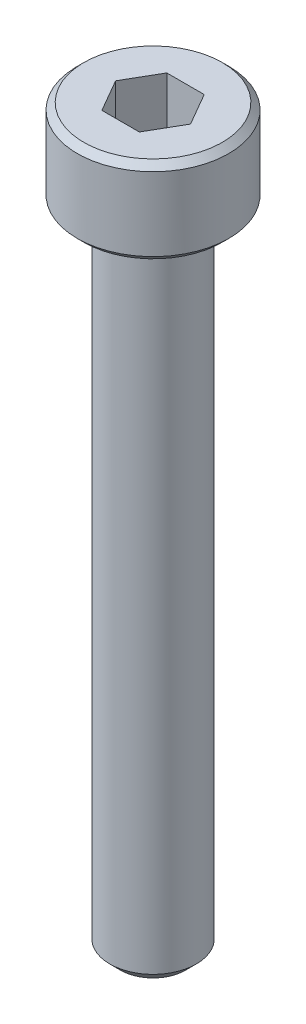
ISO-10303-21;
HEADER;
FILE_DESCRIPTION(('STEP AP214'),'2;1');
FILE_NAME('part.step','',(''),(''),'','','');
FILE_SCHEMA(('AUTOMOTIVE_DESIGN { 1 0 10303 214 1 1 1 1 }'));
ENDSEC;
DATA;
#1=APPLICATION_CONTEXT('core data for automotive mechanical design processes');
#2=APPLICATION_PROTOCOL_DEFINITION('international standard','automotive_design',2000,#1);
#3=PRODUCT_CONTEXT('',#1,'mechanical');
#4=PRODUCT('Part','Part','',(#3));
#5=PRODUCT_RELATED_PRODUCT_CATEGORY('part','',(#4));
#6=PRODUCT_DEFINITION_FORMATION('','',#4);
#7=PRODUCT_DEFINITION_CONTEXT('part definition',#1,'design');
#8=PRODUCT_DEFINITION('design','',#6,#7);
#9=PRODUCT_DEFINITION_SHAPE('','',#8);
#10=(LENGTH_UNIT() NAMED_UNIT(*) SI_UNIT(.MILLI.,.METRE.));
#11=(NAMED_UNIT(*) PLANE_ANGLE_UNIT() SI_UNIT($,.RADIAN.));
#12=(NAMED_UNIT(*) SI_UNIT($,.STERADIAN.) SOLID_ANGLE_UNIT());
#13=UNCERTAINTY_MEASURE_WITH_UNIT(LENGTH_MEASURE(1.E-05),#10,'distance_accuracy_value','');
#14=(GEOMETRIC_REPRESENTATION_CONTEXT(3) GLOBAL_UNCERTAINTY_ASSIGNED_CONTEXT((#13)) GLOBAL_UNIT_ASSIGNED_CONTEXT((#10,
#11,#12)) REPRESENTATION_CONTEXT('',''));
#15=CARTESIAN_POINT('',(0.,0.,0.));
#16=DIRECTION('',(0.,0.,1.));
#17=DIRECTION('',(1.,0.,0.));
#18=AXIS2_PLACEMENT_3D('',#15,#16,#17);
#19=CARTESIAN_POINT('',(0.866025403784439,31.,1.5));
#20=DIRECTION('',(0.866025403784439,0.,0.5));
#21=DIRECTION('',(0.5,0.,-0.866025403784439));
#22=AXIS2_PLACEMENT_3D('',#19,#20,#21);
#23=PLANE('',#22);
#24=DIRECTION('',(0.5,0.,-0.866025403784439));
#25=VECTOR('',#24,1.);
#26=CARTESIAN_POINT('',(0.866025403784439,31.,1.5));
#27=LINE('',#26,#25);
#28=CARTESIAN_POINT('',(0.866025403784439,31.,1.5));
#29=VERTEX_POINT('',#28);
#30=CARTESIAN_POINT('',(1.73205080756888,31.,0.));
#31=VERTEX_POINT('',#30);
#32=EDGE_CURVE('E66',#29,#31,#27,.T.);
#33=ORIENTED_EDGE('',*,*,#32,.F.);
#34=DIRECTION('',(0.,1.,0.));
#35=VECTOR('',#34,1.);
#36=CARTESIAN_POINT('',(0.866025403784439,31.,1.5));
#37=LINE('',#36,#35);
#38=CARTESIAN_POINT('',(0.866025403784439,34.,1.5));
#39=VERTEX_POINT('',#38);
#40=EDGE_CURVE('E85',#29,#39,#37,.T.);
#41=ORIENTED_EDGE('',*,*,#40,.T.);
#42=DIRECTION('',(0.5,0.,-0.866025403784439));
#43=VECTOR('',#42,1.);
#44=CARTESIAN_POINT('',(0.866025403784439,34.,1.5));
#45=LINE('',#44,#43);
#46=CARTESIAN_POINT('',(1.73205080756888,34.,0.));
#47=VERTEX_POINT('',#46);
#48=EDGE_CURVE('E73',#47,#39,#45,.F.);
#49=ORIENTED_EDGE('',*,*,#48,.F.);
#50=DIRECTION('',(0.,1.,0.));
#51=VECTOR('',#50,1.);
#52=CARTESIAN_POINT('',(1.73205080756888,31.,0.));
#53=LINE('',#52,#51);
#54=EDGE_CURVE('E80',#47,#31,#53,.F.);
#55=ORIENTED_EDGE('',*,*,#54,.T.);
#56=EDGE_LOOP('',(#33,#41,#49,#55));
#57=FACE_BOUND('',#56,.T.);
#58=ADVANCED_FACE('F17',(#57),#23,.F.);
#59=CARTESIAN_POINT('',(1.73205080756888,31.,0.));
#60=DIRECTION('',(0.866025403784438,0.,-0.5));
#61=DIRECTION('',(-0.5,0.,-0.866025403784438));
#62=AXIS2_PLACEMENT_3D('',#59,#60,#61);
#63=PLANE('',#62);
#64=DIRECTION('',(-0.5,0.,-0.866025403784438));
#65=VECTOR('',#64,1.);
#66=CARTESIAN_POINT('',(1.73205080756888,31.,0.));
#67=LINE('',#66,#65);
#68=CARTESIAN_POINT('',(0.866025403784438,31.,-1.5));
#69=VERTEX_POINT('',#68);
#70=EDGE_CURVE('E89',#31,#69,#67,.T.);
#71=ORIENTED_EDGE('',*,*,#70,.F.);
#72=ORIENTED_EDGE('',*,*,#54,.F.);
#73=DIRECTION('',(-0.5,0.,-0.866025403784438));
#74=VECTOR('',#73,1.);
#75=CARTESIAN_POINT('',(1.73205080756888,34.,0.));
#76=LINE('',#75,#74);
#77=CARTESIAN_POINT('',(0.866025403784439,34.,-1.5));
#78=VERTEX_POINT('',#77);
#79=EDGE_CURVE('E70',#78,#47,#76,.F.);
#80=ORIENTED_EDGE('',*,*,#79,.F.);
#81=DIRECTION('',(0.,1.,0.));
#82=VECTOR('',#81,1.);
#83=CARTESIAN_POINT('',(0.866025403784438,31.,-1.5));
#84=LINE('',#83,#82);
#85=EDGE_CURVE('E133',#78,#69,#84,.F.);
#86=ORIENTED_EDGE('',*,*,#85,.T.);
#87=EDGE_LOOP('',(#71,#72,#80,#86));
#88=FACE_BOUND('',#87,.T.);
#89=ADVANCED_FACE('F88',(#88),#63,.F.);
#90=CARTESIAN_POINT('',(-0.866025403784438,31.,1.5));
#91=DIRECTION('',(0.,0.,1.));
#92=DIRECTION('',(1.,0.,0.));
#93=AXIS2_PLACEMENT_3D('',#90,#91,#92);
#94=PLANE('',#93);
#95=DIRECTION('',(1.,0.,0.));
#96=VECTOR('',#95,1.);
#97=CARTESIAN_POINT('',(1.73205080756888,31.,1.5));
#98=LINE('',#97,#96);
#99=CARTESIAN_POINT('',(-0.866025403784438,31.,1.5));
#100=VERTEX_POINT('',#99);
#101=EDGE_CURVE('E131',#100,#29,#98,.T.);
#102=ORIENTED_EDGE('',*,*,#101,.F.);
#103=DIRECTION('',(0.,1.,0.));
#104=VECTOR('',#103,1.);
#105=CARTESIAN_POINT('',(-0.866025403784438,31.,1.5));
#106=LINE('',#105,#104);
#107=CARTESIAN_POINT('',(-0.866025403784438,34.,1.5));
#108=VERTEX_POINT('',#107);
#109=EDGE_CURVE('E121',#100,#108,#106,.T.);
#110=ORIENTED_EDGE('',*,*,#109,.T.);
#111=DIRECTION('',(1.,0.,0.));
#112=VECTOR('',#111,1.);
#113=CARTESIAN_POINT('',(-0.866025403784438,34.,1.5));
#114=LINE('',#113,#112);
#115=EDGE_CURVE('E91',#39,#108,#114,.F.);
#116=ORIENTED_EDGE('',*,*,#115,.F.);
#117=ORIENTED_EDGE('',*,*,#40,.F.);
#118=EDGE_LOOP('',(#102,#110,#116,#117));
#119=FACE_BOUND('',#118,.T.);
#120=ADVANCED_FACE('F138',(#119),#94,.F.);
#121=CARTESIAN_POINT('',(0.866025403784438,31.,-1.5));
#122=DIRECTION('',(0.,0.,-1.));
#123=DIRECTION('',(-1.,0.,0.));
#124=AXIS2_PLACEMENT_3D('',#121,#122,#123);
#125=PLANE('',#124);
#126=DIRECTION('',(1.,0.,0.));
#127=VECTOR('',#126,1.);
#128=CARTESIAN_POINT('',(1.73205080756888,31.,-1.5));
#129=LINE('',#128,#127);
#130=CARTESIAN_POINT('',(-0.866025403784438,31.,-1.5));
#131=VERTEX_POINT('',#130);
#132=EDGE_CURVE('E128',#69,#131,#129,.F.);
#133=ORIENTED_EDGE('',*,*,#132,.F.);
#134=ORIENTED_EDGE('',*,*,#85,.F.);
#135=DIRECTION('',(-1.,0.,0.));
#136=VECTOR('',#135,1.);
#137=CARTESIAN_POINT('',(0.866025403784438,34.,-1.5));
#138=LINE('',#137,#136);
#139=CARTESIAN_POINT('',(-0.866025403784438,34.,-1.5));
#140=VERTEX_POINT('',#139);
#141=EDGE_CURVE('E75',#140,#78,#138,.F.);
#142=ORIENTED_EDGE('',*,*,#141,.F.);
#143=DIRECTION('',(0.,1.,0.));
#144=VECTOR('',#143,1.);
#145=CARTESIAN_POINT('',(-0.866025403784438,31.,-1.5));
#146=LINE('',#145,#144);
#147=EDGE_CURVE('E119',#140,#131,#146,.F.);
#148=ORIENTED_EDGE('',*,*,#147,.T.);
#149=EDGE_LOOP('',(#133,#134,#142,#148));
#150=FACE_BOUND('',#149,.T.);
#151=ADVANCED_FACE('F150',(#150),#125,.F.);
#152=CARTESIAN_POINT('',(1.73205080756888,31.,0.));
#153=DIRECTION('',(0.,1.,0.));
#154=DIRECTION('',(0.,0.,1.));
#155=AXIS2_PLACEMENT_3D('',#152,#153,#154);
#156=PLANE('',#155);
#157=ORIENTED_EDGE('',*,*,#132,.T.);
#158=DIRECTION('',(-0.5,0.,0.866025403784439));
#159=VECTOR('',#158,1.);
#160=CARTESIAN_POINT('',(-0.866025403784438,31.,-1.5));
#161=LINE('',#160,#159);
#162=CARTESIAN_POINT('',(-1.73205080756888,31.,0.));
#163=VERTEX_POINT('',#162);
#164=EDGE_CURVE('E117',#131,#163,#161,.T.);
#165=ORIENTED_EDGE('',*,*,#164,.T.);
#166=DIRECTION('',(0.5,0.,0.866025403784439));
#167=VECTOR('',#166,1.);
#168=CARTESIAN_POINT('',(-1.73205080756888,31.,0.));
#169=LINE('',#168,#167);
#170=EDGE_CURVE('E124',#163,#100,#169,.T.);
#171=ORIENTED_EDGE('',*,*,#170,.T.);
#172=ORIENTED_EDGE('',*,*,#101,.T.);
#173=ORIENTED_EDGE('',*,*,#32,.T.);
#174=ORIENTED_EDGE('',*,*,#70,.T.);
#175=EDGE_LOOP('',(#157,#165,#171,#172,#173,#174));
#176=FACE_BOUND('',#175,.T.);
#177=ADVANCED_FACE('F151',(#176),#156,.T.);
#178=CARTESIAN_POINT('',(-1.73205080756888,31.,0.));
#179=DIRECTION('',(-0.866025403784439,0.,0.5));
#180=DIRECTION('',(0.5,0.,0.866025403784439));
#181=AXIS2_PLACEMENT_3D('',#178,#179,#180);
#182=PLANE('',#181);
#183=ORIENTED_EDGE('',*,*,#170,.F.);
#184=DIRECTION('',(0.,1.,0.));
#185=VECTOR('',#184,1.);
#186=CARTESIAN_POINT('',(-1.73205080756888,31.,0.));
#187=LINE('',#186,#185);
#188=CARTESIAN_POINT('',(-1.73205080756888,34.,0.));
#189=VERTEX_POINT('',#188);
#190=EDGE_CURVE('E115',#163,#189,#187,.T.);
#191=ORIENTED_EDGE('',*,*,#190,.T.);
#192=DIRECTION('',(0.5,0.,0.866025403784439));
#193=VECTOR('',#192,1.);
#194=CARTESIAN_POINT('',(-1.73205080756888,34.,0.));
#195=LINE('',#194,#193);
#196=EDGE_CURVE('E35',#108,#189,#195,.F.);
#197=ORIENTED_EDGE('',*,*,#196,.F.);
#198=ORIENTED_EDGE('',*,*,#109,.F.);
#199=EDGE_LOOP('',(#183,#191,#197,#198));
#200=FACE_BOUND('',#199,.T.);
#201=ADVANCED_FACE('F141',(#200),#182,.F.);
#202=CARTESIAN_POINT('',(-0.866025403784438,31.,-1.5));
#203=DIRECTION('',(-0.866025403784439,0.,-0.5));
#204=DIRECTION('',(-0.5,0.,0.866025403784439));
#205=AXIS2_PLACEMENT_3D('',#202,#203,#204);
#206=PLANE('',#205);
#207=ORIENTED_EDGE('',*,*,#164,.F.);
#208=ORIENTED_EDGE('',*,*,#147,.F.);
#209=DIRECTION('',(0.5,0.,-0.866025403784439));
#210=VECTOR('',#209,1.);
#211=CARTESIAN_POINT('',(-1.73205080756888,34.,0.));
#212=LINE('',#211,#210);
#213=EDGE_CURVE('E113',#189,#140,#212,.T.);
#214=ORIENTED_EDGE('',*,*,#213,.F.);
#215=ORIENTED_EDGE('',*,*,#190,.F.);
#216=EDGE_LOOP('',(#207,#208,#214,#215));
#217=FACE_BOUND('',#216,.T.);
#218=ADVANCED_FACE('F147',(#217),#206,.F.);
#219=CARTESIAN_POINT('',(0.,34.,-3.5));
#220=DIRECTION('',(0.,1.,0.));
#221=DIRECTION('',(0.,0.,1.));
#222=AXIS2_PLACEMENT_3D('',#219,#220,#221);
#223=PLANE('',#222);
#224=CARTESIAN_POINT('',(0.,34.0000000000487,0.));
#225=DIRECTION('',(0.,-1.,0.));
#226=DIRECTION('',(0.,0.,-1.));
#227=AXIS2_PLACEMENT_3D('',#224,#225,#226);
#228=CIRCLE('',#227,3.19999999999254);
#229=CARTESIAN_POINT('',(0.,34.0000000000487,-3.19999999999254));
#230=VERTEX_POINT('',#229);
#231=EDGE_CURVE('E20',#230,#230,#228,.T.);
#232=ORIENTED_EDGE('',*,*,#231,.F.);
#233=EDGE_LOOP('',(#232));
#234=FACE_BOUND('',#233,.T.);
#235=ORIENTED_EDGE('',*,*,#196,.T.);
#236=ORIENTED_EDGE('',*,*,#213,.T.);
#237=ORIENTED_EDGE('',*,*,#141,.T.);
#238=ORIENTED_EDGE('',*,*,#79,.T.);
#239=ORIENTED_EDGE('',*,*,#48,.T.);
#240=ORIENTED_EDGE('',*,*,#115,.T.);
#241=EDGE_LOOP('',(#235,#236,#237,#238,#239,#240));
#242=FACE_BOUND('',#241,.T.);
#243=ADVANCED_FACE('F72',(#234,#242),#223,.T.);
#244=CARTESIAN_POINT('',(0.,33.7000000000671,0.));
#245=DIRECTION('',(0.,-1.,0.));
#246=DIRECTION('',(0.,0.,-1.));
#247=AXIS2_PLACEMENT_3D('',#244,#245,#246);
#248=CONICAL_SURFACE('',#247,3.49999999997408,0.785398163397448);
#249=CARTESIAN_POINT('',(0.,33.7,0.));
#250=DIRECTION('',(0.,-1.,0.));
#251=DIRECTION('',(0.,0.,-1.));
#252=AXIS2_PLACEMENT_3D('',#249,#250,#251);
#253=CIRCLE('',#252,3.5);
#254=CARTESIAN_POINT('',(0.,33.7,-3.5));
#255=VERTEX_POINT('',#254);
#256=EDGE_CURVE('E106',#255,#255,#253,.T.);
#257=ORIENTED_EDGE('',*,*,#256,.F.);
#258=EDGE_LOOP('',(#257));
#259=FACE_BOUND('',#258,.T.);
#260=ORIENTED_EDGE('',*,*,#231,.T.);
#261=EDGE_LOOP('',(#260));
#262=FACE_BOUND('',#261,.T.);
#263=ADVANCED_FACE('F186',(#259,#262),#248,.T.);
#264=CARTESIAN_POINT('',(0.,0.,0.));
#265=DIRECTION('',(0.,-1.,0.));
#266=DIRECTION('',(0.,0.,-1.));
#267=AXIS2_PLACEMENT_3D('',#264,#265,#266);
#268=CYLINDRICAL_SURFACE('',#267,3.5);
#269=CARTESIAN_POINT('',(0.,30.3000000000679,0.));
#270=DIRECTION('',(0.,1.,0.));
#271=DIRECTION('',(0.,0.,1.));
#272=AXIS2_PLACEMENT_3D('',#269,#270,#271);
#273=CIRCLE('',#272,3.50000000003092);
#274=CARTESIAN_POINT('',(0.,30.3000000000679,3.50000000003092));
#275=VERTEX_POINT('',#274);
#276=EDGE_CURVE('E102',#275,#275,#273,.F.);
#277=ORIENTED_EDGE('',*,*,#276,.F.);
#278=EDGE_LOOP('',(#277));
#279=FACE_BOUND('',#278,.T.);
#280=ORIENTED_EDGE('',*,*,#256,.T.);
#281=EDGE_LOOP('',(#280));
#282=FACE_BOUND('',#281,.T.);
#283=ADVANCED_FACE('F183',(#279,#282),#268,.T.);
#284=CARTESIAN_POINT('',(0.,30.3000000000111,0.));
#285=DIRECTION('',(0.,1.,0.));
#286=DIRECTION('',(0.,0.,1.));
#287=AXIS2_PLACEMENT_3D('',#284,#285,#286);
#288=CONICAL_SURFACE('',#287,3.49999999997408,0.785398163397448);
#289=ORIENTED_EDGE('',*,*,#276,.T.);
#290=EDGE_LOOP('',(#289));
#291=FACE_BOUND('',#290,.T.);
#292=CARTESIAN_POINT('',(0.,30.0000000000296,0.));
#293=DIRECTION('',(0.,1.,0.));
#294=DIRECTION('',(0.,0.,1.));
#295=AXIS2_PLACEMENT_3D('',#292,#293,#294);
#296=CIRCLE('',#295,3.19999999999254);
#297=CARTESIAN_POINT('',(0.,30.0000000000296,3.19999999999254));
#298=VERTEX_POINT('',#297);
#299=EDGE_CURVE('E100',#298,#298,#296,.F.);
#300=ORIENTED_EDGE('',*,*,#299,.F.);
#301=EDGE_LOOP('',(#300));
#302=FACE_BOUND('',#301,.T.);
#303=ADVANCED_FACE('F179',(#291,#302),#288,.T.);
#304=CARTESIAN_POINT('',(0.,0.,0.));
#305=DIRECTION('',(0.,-1.,0.));
#306=DIRECTION('',(0.,0.,-1.));
#307=AXIS2_PLACEMENT_3D('',#304,#305,#306);
#308=PLANE('',#307);
#309=CARTESIAN_POINT('',(0.,1.13686837721616E-10,0.));
#310=DIRECTION('',(0.,1.,0.));
#311=DIRECTION('',(0.,0.,1.));
#312=AXIS2_PLACEMENT_3D('',#309,#310,#311);
#313=CIRCLE('',#312,1.50000000002137);
#314=CARTESIAN_POINT('',(0.,1.13686837721616E-10,1.50000000002137));
#315=VERTEX_POINT('',#314);
#316=EDGE_CURVE('E98',#315,#315,#313,.T.);
#317=ORIENTED_EDGE('',*,*,#316,.F.);
#318=EDGE_LOOP('',(#317));
#319=FACE_BOUND('',#318,.T.);
#320=ADVANCED_FACE('F176',(#319),#308,.T.);
#321=CARTESIAN_POINT('',(0.,30.,-2.));
#322=DIRECTION('',(0.,-1.,0.));
#323=DIRECTION('',(0.,0.,-1.));
#324=AXIS2_PLACEMENT_3D('',#321,#322,#323);
#325=PLANE('',#324);
#326=ORIENTED_EDGE('',*,*,#299,.T.);
#327=EDGE_LOOP('',(#326));
#328=FACE_BOUND('',#327,.T.);
#329=CARTESIAN_POINT('',(0.,30.,0.));
#330=DIRECTION('',(0.,-1.,0.));
#331=DIRECTION('',(0.,0.,-1.));
#332=AXIS2_PLACEMENT_3D('',#329,#330,#331);
#333=CIRCLE('',#332,2.);
#334=CARTESIAN_POINT('',(0.,30.,-2.));
#335=VERTEX_POINT('',#334);
#336=EDGE_CURVE('E26',#335,#335,#333,.T.);
#337=ORIENTED_EDGE('',*,*,#336,.F.);
#338=EDGE_LOOP('',(#337));
#339=FACE_BOUND('',#338,.T.);
#340=ADVANCED_FACE('F169',(#328,#339),#325,.T.);
#341=CARTESIAN_POINT('',(0.,0.50000000004502,0.));
#342=DIRECTION('',(0.,1.,0.));
#343=DIRECTION('',(0.,0.,1.));
#344=AXIS2_PLACEMENT_3D('',#341,#342,#343);
#345=CONICAL_SURFACE('',#344,1.99999999995271,0.785398163397448);
#346=CARTESIAN_POINT('',(0.,0.500000000000006,0.));
#347=DIRECTION('',(0.,-1.,0.));
#348=DIRECTION('',(0.,0.,-1.));
#349=AXIS2_PLACEMENT_3D('',#346,#347,#348);
#350=CIRCLE('',#349,2.);
#351=CARTESIAN_POINT('',(0.,0.500000000000006,-2.));
#352=VERTEX_POINT('',#351);
#353=EDGE_CURVE('E11',#352,#352,#350,.F.);
#354=ORIENTED_EDGE('',*,*,#353,.F.);
#355=EDGE_LOOP('',(#354));
#356=FACE_BOUND('',#355,.T.);
#357=ORIENTED_EDGE('',*,*,#316,.T.);
#358=EDGE_LOOP('',(#357));
#359=FACE_BOUND('',#358,.T.);
#360=ADVANCED_FACE('F163',(#356,#359),#345,.T.);
#361=CARTESIAN_POINT('',(0.,0.,0.));
#362=DIRECTION('',(0.,-1.,0.));
#363=DIRECTION('',(0.,0.,-1.));
#364=AXIS2_PLACEMENT_3D('',#361,#362,#363);
#365=CYLINDRICAL_SURFACE('',#364,2.);
#366=ORIENTED_EDGE('',*,*,#353,.T.);
#367=EDGE_LOOP('',(#366));
#368=FACE_BOUND('',#367,.T.);
#369=ORIENTED_EDGE('',*,*,#336,.T.);
#370=EDGE_LOOP('',(#369));
#371=FACE_BOUND('',#370,.T.);
#372=ADVANCED_FACE('F161',(#368,#371),#365,.T.);
#373=CLOSED_SHELL('',(#58,#89,#120,#151,#177,#201,#218,#243,#263,#283,#303,#320,#340,#360,#372));
#374=MANIFOLD_SOLID_BREP('B1',#373);
#375=ADVANCED_BREP_SHAPE_REPRESENTATION('',(#18,#374),#14);
#376=SHAPE_DEFINITION_REPRESENTATION(#9,#375);
ENDSEC;
END-ISO-10303-21;
